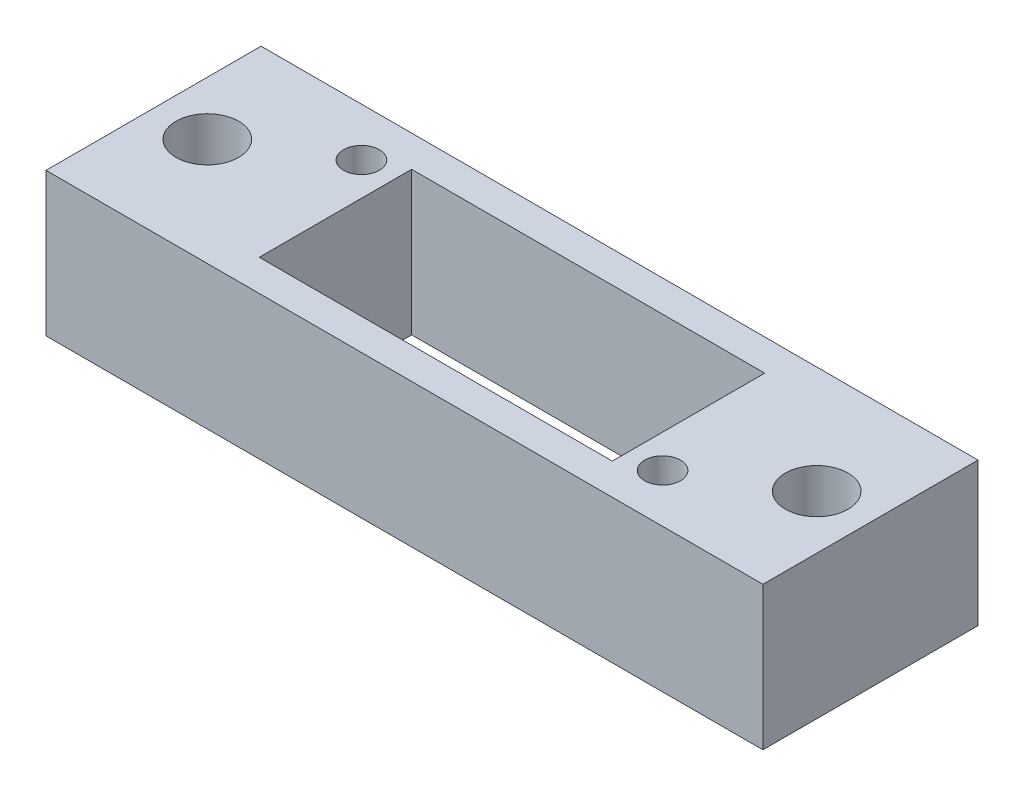
ISO-10303-21;
HEADER;
FILE_DESCRIPTION(('STEP AP214'),'2;1');
FILE_NAME('part.step','',(''),(''),'','','');
FILE_SCHEMA(('AUTOMOTIVE_DESIGN { 1 0 10303 214 1 1 1 1 }'));
ENDSEC;
DATA;
#1=APPLICATION_CONTEXT('core data for automotive mechanical design processes');
#2=APPLICATION_PROTOCOL_DEFINITION('international standard','automotive_design',2000,#1);
#3=PRODUCT_CONTEXT('',#1,'mechanical');
#4=PRODUCT('Part','Part','',(#3));
#5=PRODUCT_RELATED_PRODUCT_CATEGORY('part','',(#4));
#6=PRODUCT_DEFINITION_FORMATION('','',#4);
#7=PRODUCT_DEFINITION_CONTEXT('part definition',#1,'design');
#8=PRODUCT_DEFINITION('design','',#6,#7);
#9=PRODUCT_DEFINITION_SHAPE('','',#8);
#10=(LENGTH_UNIT() NAMED_UNIT(*) SI_UNIT(.MILLI.,.METRE.));
#11=(NAMED_UNIT(*) PLANE_ANGLE_UNIT() SI_UNIT($,.RADIAN.));
#12=(NAMED_UNIT(*) SI_UNIT($,.STERADIAN.) SOLID_ANGLE_UNIT());
#13=UNCERTAINTY_MEASURE_WITH_UNIT(LENGTH_MEASURE(1.E-05),#10,'distance_accuracy_value','');
#14=(GEOMETRIC_REPRESENTATION_CONTEXT(3) GLOBAL_UNCERTAINTY_ASSIGNED_CONTEXT((#13)) GLOBAL_UNIT_ASSIGNED_CONTEXT((#10,
#11,#12)) REPRESENTATION_CONTEXT('',''));
#15=CARTESIAN_POINT('',(0.,0.,0.));
#16=DIRECTION('',(0.,0.,1.));
#17=DIRECTION('',(1.,0.,0.));
#18=AXIS2_PLACEMENT_3D('',#15,#16,#17);
#19=CARTESIAN_POINT('',(-20.,8.,-6.));
#20=DIRECTION('',(1.,0.,0.));
#21=DIRECTION('',(0.,0.,-1.));
#22=AXIS2_PLACEMENT_3D('',#19,#20,#21);
#23=PLANE('',#22);
#24=DIRECTION('',(0.,0.,1.));
#25=VECTOR('',#24,1.);
#26=CARTESIAN_POINT('',(-20.,0.,-6.));
#27=LINE('',#26,#25);
#28=CARTESIAN_POINT('',(-20.,0.,-6.));
#29=VERTEX_POINT('',#28);
#30=CARTESIAN_POINT('',(-20.,0.,6.));
#31=VERTEX_POINT('',#30);
#32=EDGE_CURVE('E136',#29,#31,#27,.T.);
#33=ORIENTED_EDGE('',*,*,#32,.T.);
#34=DIRECTION('',(0.,-1.,0.));
#35=VECTOR('',#34,1.);
#36=CARTESIAN_POINT('',(-20.,8.,6.));
#37=LINE('',#36,#35);
#38=CARTESIAN_POINT('',(-20.,8.,6.));
#39=VERTEX_POINT('',#38);
#40=EDGE_CURVE('E11',#39,#31,#37,.T.);
#41=ORIENTED_EDGE('',*,*,#40,.F.);
#42=DIRECTION('',(0.,0.,1.));
#43=VECTOR('',#42,1.);
#44=CARTESIAN_POINT('',(-20.,8.,-6.));
#45=LINE('',#44,#43);
#46=CARTESIAN_POINT('',(-20.,8.,-6.));
#47=VERTEX_POINT('',#46);
#48=EDGE_CURVE('E140',#47,#39,#45,.T.);
#49=ORIENTED_EDGE('',*,*,#48,.F.);
#50=DIRECTION('',(0.,-1.,0.));
#51=VECTOR('',#50,1.);
#52=CARTESIAN_POINT('',(-20.,8.,-6.));
#53=LINE('',#52,#51);
#54=EDGE_CURVE('E150',#47,#29,#53,.T.);
#55=ORIENTED_EDGE('',*,*,#54,.T.);
#56=EDGE_LOOP('',(#33,#41,#49,#55));
#57=FACE_BOUND('',#56,.T.);
#58=ADVANCED_FACE('F33',(#57),#23,.F.);
#59=CARTESIAN_POINT('',(-20.,8.,6.));
#60=DIRECTION('',(0.,0.,-1.));
#61=DIRECTION('',(-1.,0.,0.));
#62=AXIS2_PLACEMENT_3D('',#59,#60,#61);
#63=PLANE('',#62);
#64=DIRECTION('',(1.,0.,0.));
#65=VECTOR('',#64,1.);
#66=CARTESIAN_POINT('',(-20.,0.,6.));
#67=LINE('',#66,#65);
#68=CARTESIAN_POINT('',(20.,0.,6.));
#69=VERTEX_POINT('',#68);
#70=EDGE_CURVE('E153',#31,#69,#67,.T.);
#71=ORIENTED_EDGE('',*,*,#70,.T.);
#72=DIRECTION('',(0.,-1.,0.));
#73=VECTOR('',#72,1.);
#74=CARTESIAN_POINT('',(20.,8.,6.));
#75=LINE('',#74,#73);
#76=CARTESIAN_POINT('',(20.,8.,6.));
#77=VERTEX_POINT('',#76);
#78=EDGE_CURVE('E41',#77,#69,#75,.T.);
#79=ORIENTED_EDGE('',*,*,#78,.F.);
#80=DIRECTION('',(1.,0.,0.));
#81=VECTOR('',#80,1.);
#82=CARTESIAN_POINT('',(-20.,8.,6.));
#83=LINE('',#82,#81);
#84=EDGE_CURVE('E143',#39,#77,#83,.T.);
#85=ORIENTED_EDGE('',*,*,#84,.F.);
#86=ORIENTED_EDGE('',*,*,#40,.T.);
#87=EDGE_LOOP('',(#71,#79,#85,#86));
#88=FACE_BOUND('',#87,.T.);
#89=ADVANCED_FACE('F206',(#88),#63,.F.);
#90=CARTESIAN_POINT('',(20.,8.,-6.));
#91=DIRECTION('',(-1.,0.,0.));
#92=DIRECTION('',(0.,0.,1.));
#93=AXIS2_PLACEMENT_3D('',#90,#91,#92);
#94=PLANE('',#93);
#95=DIRECTION('',(0.,0.,-1.));
#96=VECTOR('',#95,1.);
#97=CARTESIAN_POINT('',(20.,0.,-6.));
#98=LINE('',#97,#96);
#99=CARTESIAN_POINT('',(20.,0.,-6.));
#100=VERTEX_POINT('',#99);
#101=EDGE_CURVE('E155',#69,#100,#98,.T.);
#102=ORIENTED_EDGE('',*,*,#101,.T.);
#103=DIRECTION('',(0.,-1.,0.));
#104=VECTOR('',#103,1.);
#105=CARTESIAN_POINT('',(20.,8.,-6.));
#106=LINE('',#105,#104);
#107=CARTESIAN_POINT('',(20.,8.,-6.));
#108=VERTEX_POINT('',#107);
#109=EDGE_CURVE('E160',#108,#100,#106,.T.);
#110=ORIENTED_EDGE('',*,*,#109,.F.);
#111=DIRECTION('',(0.,0.,-1.));
#112=VECTOR('',#111,1.);
#113=CARTESIAN_POINT('',(20.,8.,-6.));
#114=LINE('',#113,#112);
#115=EDGE_CURVE('E146',#77,#108,#114,.T.);
#116=ORIENTED_EDGE('',*,*,#115,.F.);
#117=ORIENTED_EDGE('',*,*,#78,.T.);
#118=EDGE_LOOP('',(#102,#110,#116,#117));
#119=FACE_BOUND('',#118,.T.);
#120=ADVANCED_FACE('F211',(#119),#94,.F.);
#121=CARTESIAN_POINT('',(-20.,8.,-6.));
#122=DIRECTION('',(0.,0.,1.));
#123=DIRECTION('',(1.,0.,0.));
#124=AXIS2_PLACEMENT_3D('',#121,#122,#123);
#125=PLANE('',#124);
#126=DIRECTION('',(-1.,0.,0.));
#127=VECTOR('',#126,1.);
#128=CARTESIAN_POINT('',(-20.,0.,-6.));
#129=LINE('',#128,#127);
#130=EDGE_CURVE('E144',#100,#29,#129,.T.);
#131=ORIENTED_EDGE('',*,*,#130,.T.);
#132=ORIENTED_EDGE('',*,*,#54,.F.);
#133=DIRECTION('',(-1.,0.,0.));
#134=VECTOR('',#133,1.);
#135=CARTESIAN_POINT('',(-20.,8.,-6.));
#136=LINE('',#135,#134);
#137=EDGE_CURVE('E148',#108,#47,#136,.T.);
#138=ORIENTED_EDGE('',*,*,#137,.F.);
#139=ORIENTED_EDGE('',*,*,#109,.T.);
#140=EDGE_LOOP('',(#131,#132,#138,#139));
#141=FACE_BOUND('',#140,.T.);
#142=ADVANCED_FACE('F193',(#141),#125,.F.);
#143=CARTESIAN_POINT('',(0.,8.,0.));
#144=DIRECTION('',(0.,1.,0.));
#145=DIRECTION('',(0.,0.,1.));
#146=AXIS2_PLACEMENT_3D('',#143,#144,#145);
#147=PLANE('',#146);
#148=CARTESIAN_POINT('',(16.999999999998,8.,0.));
#149=DIRECTION('',(0.,1.,0.));
#150=DIRECTION('',(0.,0.,1.));
#151=AXIS2_PLACEMENT_3D('',#148,#149,#150);
#152=CIRCLE('',#151,1.75);
#153=CARTESIAN_POINT('',(16.999999999998,8.,1.75));
#154=VERTEX_POINT('',#153);
#155=EDGE_CURVE('E178',#154,#154,#152,.T.);
#156=ORIENTED_EDGE('',*,*,#155,.F.);
#157=EDGE_LOOP('',(#156));
#158=FACE_BOUND('',#157,.T.);
#159=CARTESIAN_POINT('',(-16.999999999998,8.,0.));
#160=DIRECTION('',(0.,1.,0.));
#161=DIRECTION('',(0.,0.,1.));
#162=AXIS2_PLACEMENT_3D('',#159,#160,#161);
#163=CIRCLE('',#162,1.75);
#164=CARTESIAN_POINT('',(-16.999999999998,8.,1.75));
#165=VERTEX_POINT('',#164);
#166=EDGE_CURVE('E167',#165,#165,#163,.T.);
#167=ORIENTED_EDGE('',*,*,#166,.F.);
#168=EDGE_LOOP('',(#167));
#169=FACE_BOUND('',#168,.T.);
#170=CARTESIAN_POINT('',(11.6999999999952,8.,3.29999999999793));
#171=DIRECTION('',(0.,1.,0.));
#172=DIRECTION('',(0.,0.,1.));
#173=AXIS2_PLACEMENT_3D('',#170,#171,#172);
#174=CIRCLE('',#173,1.);
#175=CARTESIAN_POINT('',(11.6999999999952,8.,4.29999999999793));
#176=VERTEX_POINT('',#175);
#177=EDGE_CURVE('E166',#176,#176,#174,.T.);
#178=ORIENTED_EDGE('',*,*,#177,.F.);
#179=EDGE_LOOP('',(#178));
#180=FACE_BOUND('',#179,.T.);
#181=CARTESIAN_POINT('',(-11.6999999999952,8.,-3.29999999999793));
#182=DIRECTION('',(0.,1.,0.));
#183=DIRECTION('',(0.,0.,1.));
#184=AXIS2_PLACEMENT_3D('',#181,#182,#183);
#185=CIRCLE('',#184,1.);
#186=CARTESIAN_POINT('',(-11.6999999999952,8.,-2.29999999999793));
#187=VERTEX_POINT('',#186);
#188=EDGE_CURVE('E123',#187,#187,#185,.T.);
#189=ORIENTED_EDGE('',*,*,#188,.F.);
#190=EDGE_LOOP('',(#189));
#191=FACE_BOUND('',#190,.T.);
#192=DIRECTION('',(0.,0.,1.));
#193=VECTOR('',#192,1.);
#194=CARTESIAN_POINT('',(-9.85,8.,-4.25));
#195=LINE('',#194,#193);
#196=CARTESIAN_POINT('',(-9.85,8.,-4.25));
#197=VERTEX_POINT('',#196);
#198=CARTESIAN_POINT('',(-9.85,8.,4.25));
#199=VERTEX_POINT('',#198);
#200=EDGE_CURVE('E49',#197,#199,#195,.T.);
#201=ORIENTED_EDGE('',*,*,#200,.F.);
#202=DIRECTION('',(-1.,0.,0.));
#203=VECTOR('',#202,1.);
#204=CARTESIAN_POINT('',(-9.85,8.,-4.25));
#205=LINE('',#204,#203);
#206=CARTESIAN_POINT('',(9.85,8.,-4.25));
#207=VERTEX_POINT('',#206);
#208=EDGE_CURVE('E117',#207,#197,#205,.T.);
#209=ORIENTED_EDGE('',*,*,#208,.F.);
#210=DIRECTION('',(0.,0.,-1.));
#211=VECTOR('',#210,1.);
#212=CARTESIAN_POINT('',(9.85,8.,-4.25));
#213=LINE('',#212,#211);
#214=CARTESIAN_POINT('',(9.85,8.,4.25));
#215=VERTEX_POINT('',#214);
#216=EDGE_CURVE('E120',#215,#207,#213,.T.);
#217=ORIENTED_EDGE('',*,*,#216,.F.);
#218=DIRECTION('',(1.,0.,0.));
#219=VECTOR('',#218,1.);
#220=CARTESIAN_POINT('',(-9.85,8.,4.25));
#221=LINE('',#220,#219);
#222=EDGE_CURVE('E129',#199,#215,#221,.T.);
#223=ORIENTED_EDGE('',*,*,#222,.F.);
#224=EDGE_LOOP('',(#201,#209,#217,#223));
#225=FACE_BOUND('',#224,.T.);
#226=ORIENTED_EDGE('',*,*,#48,.T.);
#227=ORIENTED_EDGE('',*,*,#84,.T.);
#228=ORIENTED_EDGE('',*,*,#115,.T.);
#229=ORIENTED_EDGE('',*,*,#137,.T.);
#230=EDGE_LOOP('',(#226,#227,#228,#229));
#231=FACE_BOUND('',#230,.T.);
#232=ADVANCED_FACE('F190',(#158,#169,#180,#191,#225,#231),#147,.T.);
#233=CARTESIAN_POINT('',(0.,0.,0.));
#234=DIRECTION('',(0.,1.,0.));
#235=DIRECTION('',(0.,0.,1.));
#236=AXIS2_PLACEMENT_3D('',#233,#234,#235);
#237=PLANE('',#236);
#238=CARTESIAN_POINT('',(16.999999999998,0.,0.));
#239=DIRECTION('',(0.,1.,0.));
#240=DIRECTION('',(0.,0.,1.));
#241=AXIS2_PLACEMENT_3D('',#238,#239,#240);
#242=CIRCLE('',#241,1.75);
#243=CARTESIAN_POINT('',(16.999999999998,0.,1.75));
#244=VERTEX_POINT('',#243);
#245=EDGE_CURVE('E36',#244,#244,#242,.T.);
#246=ORIENTED_EDGE('',*,*,#245,.T.);
#247=EDGE_LOOP('',(#246));
#248=FACE_BOUND('',#247,.T.);
#249=CARTESIAN_POINT('',(-16.999999999998,0.,0.));
#250=DIRECTION('',(0.,1.,0.));
#251=DIRECTION('',(0.,0.,1.));
#252=AXIS2_PLACEMENT_3D('',#249,#250,#251);
#253=CIRCLE('',#252,1.75);
#254=CARTESIAN_POINT('',(-16.999999999998,0.,1.75));
#255=VERTEX_POINT('',#254);
#256=EDGE_CURVE('E164',#255,#255,#253,.T.);
#257=ORIENTED_EDGE('',*,*,#256,.T.);
#258=EDGE_LOOP('',(#257));
#259=FACE_BOUND('',#258,.T.);
#260=CARTESIAN_POINT('',(11.6999999999952,0.,3.29999999999793));
#261=DIRECTION('',(0.,1.,0.));
#262=DIRECTION('',(0.,0.,1.));
#263=AXIS2_PLACEMENT_3D('',#260,#261,#262);
#264=CIRCLE('',#263,1.);
#265=CARTESIAN_POINT('',(11.6999999999952,0.,4.29999999999793));
#266=VERTEX_POINT('',#265);
#267=EDGE_CURVE('E171',#266,#266,#264,.T.);
#268=ORIENTED_EDGE('',*,*,#267,.T.);
#269=EDGE_LOOP('',(#268));
#270=FACE_BOUND('',#269,.T.);
#271=CARTESIAN_POINT('',(-11.6999999999952,0.,-3.29999999999793));
#272=DIRECTION('',(0.,1.,0.));
#273=DIRECTION('',(0.,0.,1.));
#274=AXIS2_PLACEMENT_3D('',#271,#272,#273);
#275=CIRCLE('',#274,1.);
#276=CARTESIAN_POINT('',(-11.6999999999952,0.,-2.29999999999793));
#277=VERTEX_POINT('',#276);
#278=EDGE_CURVE('E130',#277,#277,#275,.T.);
#279=ORIENTED_EDGE('',*,*,#278,.T.);
#280=EDGE_LOOP('',(#279));
#281=FACE_BOUND('',#280,.T.);
#282=DIRECTION('',(-1.,0.,0.));
#283=VECTOR('',#282,1.);
#284=CARTESIAN_POINT('',(-9.85,0.,-4.25));
#285=LINE('',#284,#283);
#286=CARTESIAN_POINT('',(9.85,0.,-4.25));
#287=VERTEX_POINT('',#286);
#288=CARTESIAN_POINT('',(-9.85,0.,-4.25));
#289=VERTEX_POINT('',#288);
#290=EDGE_CURVE('E107',#287,#289,#285,.T.);
#291=ORIENTED_EDGE('',*,*,#290,.T.);
#292=DIRECTION('',(0.,0.,1.));
#293=VECTOR('',#292,1.);
#294=CARTESIAN_POINT('',(-9.85,0.,-4.25));
#295=LINE('',#294,#293);
#296=CARTESIAN_POINT('',(-9.85,0.,4.25));
#297=VERTEX_POINT('',#296);
#298=EDGE_CURVE('E101',#289,#297,#295,.T.);
#299=ORIENTED_EDGE('',*,*,#298,.T.);
#300=DIRECTION('',(1.,0.,0.));
#301=VECTOR('',#300,1.);
#302=CARTESIAN_POINT('',(-9.85,0.,4.25));
#303=LINE('',#302,#301);
#304=CARTESIAN_POINT('',(9.85,0.,4.25));
#305=VERTEX_POINT('',#304);
#306=EDGE_CURVE('E110',#297,#305,#303,.T.);
#307=ORIENTED_EDGE('',*,*,#306,.T.);
#308=DIRECTION('',(0.,0.,-1.));
#309=VECTOR('',#308,1.);
#310=CARTESIAN_POINT('',(9.85,0.,-4.25));
#311=LINE('',#310,#309);
#312=EDGE_CURVE('E57',#305,#287,#311,.T.);
#313=ORIENTED_EDGE('',*,*,#312,.T.);
#314=EDGE_LOOP('',(#291,#299,#307,#313));
#315=FACE_BOUND('',#314,.T.);
#316=ORIENTED_EDGE('',*,*,#32,.F.);
#317=ORIENTED_EDGE('',*,*,#130,.F.);
#318=ORIENTED_EDGE('',*,*,#101,.F.);
#319=ORIENTED_EDGE('',*,*,#70,.F.);
#320=EDGE_LOOP('',(#316,#317,#318,#319));
#321=FACE_BOUND('',#320,.T.);
#322=ADVANCED_FACE('F114',(#248,#259,#270,#281,#315,#321),#237,.F.);
#323=CARTESIAN_POINT('',(-9.85,0.,-4.25));
#324=DIRECTION('',(-1.,0.,0.));
#325=DIRECTION('',(0.,0.,1.));
#326=AXIS2_PLACEMENT_3D('',#323,#324,#325);
#327=PLANE('',#326);
#328=ORIENTED_EDGE('',*,*,#200,.T.);
#329=DIRECTION('',(0.,1.,0.));
#330=VECTOR('',#329,1.);
#331=CARTESIAN_POINT('',(-9.85,0.,4.25));
#332=LINE('',#331,#330);
#333=EDGE_CURVE('E97',#297,#199,#332,.T.);
#334=ORIENTED_EDGE('',*,*,#333,.F.);
#335=ORIENTED_EDGE('',*,*,#298,.F.);
#336=DIRECTION('',(0.,1.,0.));
#337=VECTOR('',#336,1.);
#338=CARTESIAN_POINT('',(-9.85,0.,-4.25));
#339=LINE('',#338,#337);
#340=EDGE_CURVE('E134',#289,#197,#339,.T.);
#341=ORIENTED_EDGE('',*,*,#340,.T.);
#342=EDGE_LOOP('',(#328,#334,#335,#341));
#343=FACE_BOUND('',#342,.T.);
#344=ADVANCED_FACE('F99',(#343),#327,.F.);
#345=CARTESIAN_POINT('',(-9.85,0.,-4.25));
#346=DIRECTION('',(0.,0.,-1.));
#347=DIRECTION('',(-1.,0.,0.));
#348=AXIS2_PLACEMENT_3D('',#345,#346,#347);
#349=PLANE('',#348);
#350=ORIENTED_EDGE('',*,*,#208,.T.);
#351=ORIENTED_EDGE('',*,*,#340,.F.);
#352=ORIENTED_EDGE('',*,*,#290,.F.);
#353=DIRECTION('',(0.,1.,0.));
#354=VECTOR('',#353,1.);
#355=CARTESIAN_POINT('',(9.85,0.,-4.25));
#356=LINE('',#355,#354);
#357=EDGE_CURVE('E137',#287,#207,#356,.T.);
#358=ORIENTED_EDGE('',*,*,#357,.T.);
#359=EDGE_LOOP('',(#350,#351,#352,#358));
#360=FACE_BOUND('',#359,.T.);
#361=ADVANCED_FACE('F220',(#360),#349,.F.);
#362=CARTESIAN_POINT('',(9.85,0.,-4.25));
#363=DIRECTION('',(1.,0.,0.));
#364=DIRECTION('',(0.,0.,-1.));
#365=AXIS2_PLACEMENT_3D('',#362,#363,#364);
#366=PLANE('',#365);
#367=ORIENTED_EDGE('',*,*,#216,.T.);
#368=ORIENTED_EDGE('',*,*,#357,.F.);
#369=ORIENTED_EDGE('',*,*,#312,.F.);
#370=DIRECTION('',(0.,1.,0.));
#371=VECTOR('',#370,1.);
#372=CARTESIAN_POINT('',(9.85,0.,4.25));
#373=LINE('',#372,#371);
#374=EDGE_CURVE('E106',#305,#215,#373,.T.);
#375=ORIENTED_EDGE('',*,*,#374,.T.);
#376=EDGE_LOOP('',(#367,#368,#369,#375));
#377=FACE_BOUND('',#376,.T.);
#378=ADVANCED_FACE('F285',(#377),#366,.F.);
#379=CARTESIAN_POINT('',(-9.85,0.,4.25));
#380=DIRECTION('',(0.,0.,1.));
#381=DIRECTION('',(1.,0.,0.));
#382=AXIS2_PLACEMENT_3D('',#379,#380,#381);
#383=PLANE('',#382);
#384=ORIENTED_EDGE('',*,*,#222,.T.);
#385=ORIENTED_EDGE('',*,*,#374,.F.);
#386=ORIENTED_EDGE('',*,*,#306,.F.);
#387=ORIENTED_EDGE('',*,*,#333,.T.);
#388=EDGE_LOOP('',(#384,#385,#386,#387));
#389=FACE_BOUND('',#388,.T.);
#390=ADVANCED_FACE('F111',(#389),#383,.F.);
#391=CARTESIAN_POINT('',(-11.6999999999952,0.,-3.29999999999793));
#392=DIRECTION('',(0.,1.,0.));
#393=DIRECTION('',(0.,0.,1.));
#394=AXIS2_PLACEMENT_3D('',#391,#392,#393);
#395=CYLINDRICAL_SURFACE('',#394,1.);
#396=ORIENTED_EDGE('',*,*,#278,.F.);
#397=EDGE_LOOP('',(#396));
#398=FACE_BOUND('',#397,.T.);
#399=ORIENTED_EDGE('',*,*,#188,.T.);
#400=EDGE_LOOP('',(#399));
#401=FACE_BOUND('',#400,.T.);
#402=ADVANCED_FACE('F188',(#398,#401),#395,.F.);
#403=CARTESIAN_POINT('',(11.6999999999952,0.,3.29999999999793));
#404=DIRECTION('',(0.,1.,0.));
#405=DIRECTION('',(0.,0.,1.));
#406=AXIS2_PLACEMENT_3D('',#403,#404,#405);
#407=CYLINDRICAL_SURFACE('',#406,1.);
#408=ORIENTED_EDGE('',*,*,#267,.F.);
#409=EDGE_LOOP('',(#408));
#410=FACE_BOUND('',#409,.T.);
#411=ORIENTED_EDGE('',*,*,#177,.T.);
#412=EDGE_LOOP('',(#411));
#413=FACE_BOUND('',#412,.T.);
#414=ADVANCED_FACE('F247',(#410,#413),#407,.F.);
#415=CARTESIAN_POINT('',(-16.999999999998,-2.,0.));
#416=DIRECTION('',(0.,1.,0.));
#417=DIRECTION('',(0.,0.,1.));
#418=AXIS2_PLACEMENT_3D('',#415,#416,#417);
#419=CYLINDRICAL_SURFACE('',#418,1.75);
#420=ORIENTED_EDGE('',*,*,#166,.T.);
#421=EDGE_LOOP('',(#420));
#422=FACE_BOUND('',#421,.T.);
#423=ORIENTED_EDGE('',*,*,#256,.F.);
#424=EDGE_LOOP('',(#423));
#425=FACE_BOUND('',#424,.T.);
#426=ADVANCED_FACE('F257',(#422,#425),#419,.F.);
#427=CARTESIAN_POINT('',(16.999999999998,-2.,0.));
#428=DIRECTION('',(0.,1.,0.));
#429=DIRECTION('',(0.,0.,1.));
#430=AXIS2_PLACEMENT_3D('',#427,#428,#429);
#431=CYLINDRICAL_SURFACE('',#430,1.75);
#432=ORIENTED_EDGE('',*,*,#155,.T.);
#433=EDGE_LOOP('',(#432));
#434=FACE_BOUND('',#433,.T.);
#435=ORIENTED_EDGE('',*,*,#245,.F.);
#436=EDGE_LOOP('',(#435));
#437=FACE_BOUND('',#436,.T.);
#438=ADVANCED_FACE('F262',(#434,#437),#431,.F.);
#439=CLOSED_SHELL('',(#58,#89,#120,#142,#232,#322,#344,#361,#378,#390,#402,#414,#426,#438));
#440=MANIFOLD_SOLID_BREP('B2',#439);
#441=ADVANCED_BREP_SHAPE_REPRESENTATION('',(#18,#440),#14);
#442=SHAPE_DEFINITION_REPRESENTATION(#9,#441);
ENDSEC;
END-ISO-10303-21;
